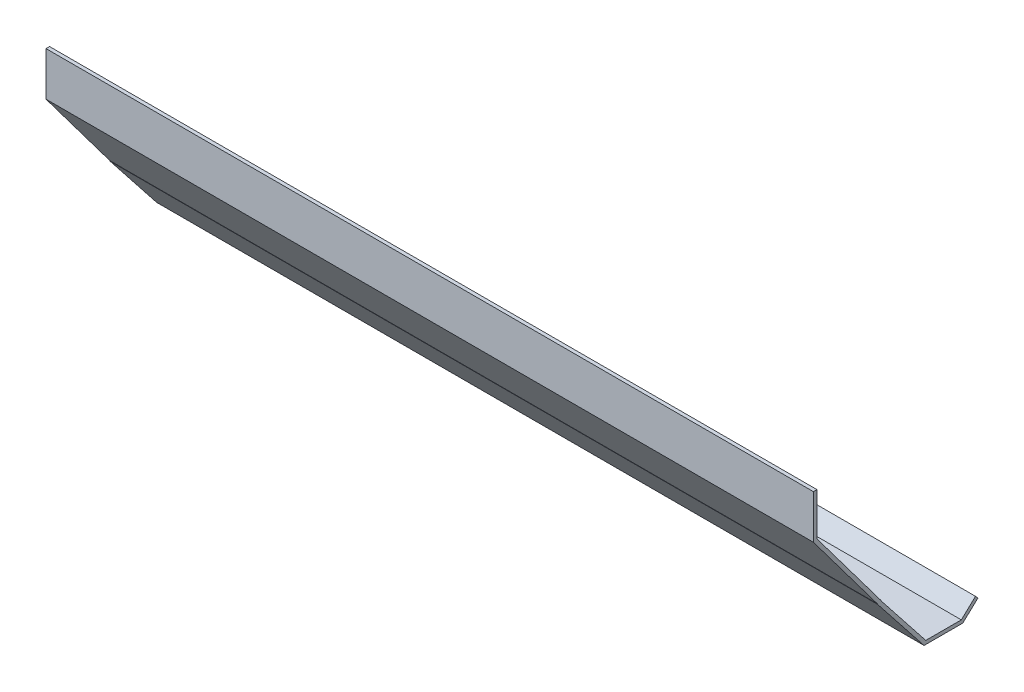
ISO-10303-21;
HEADER;
FILE_DESCRIPTION(('STEP AP214'),'2;1');
FILE_NAME('part.step','',(''),(''),'','','');
FILE_SCHEMA(('AUTOMOTIVE_DESIGN { 1 0 10303 214 1 1 1 1 }'));
ENDSEC;
DATA;
#1=APPLICATION_CONTEXT('core data for automotive mechanical design processes');
#2=APPLICATION_PROTOCOL_DEFINITION('international standard','automotive_design',2000,#1);
#3=PRODUCT_CONTEXT('',#1,'mechanical');
#4=PRODUCT('Part','Part','',(#3));
#5=PRODUCT_RELATED_PRODUCT_CATEGORY('part','',(#4));
#6=PRODUCT_DEFINITION_FORMATION('','',#4);
#7=PRODUCT_DEFINITION_CONTEXT('part definition',#1,'design');
#8=PRODUCT_DEFINITION('design','',#6,#7);
#9=PRODUCT_DEFINITION_SHAPE('','',#8);
#10=(LENGTH_UNIT() NAMED_UNIT(*) SI_UNIT(.MILLI.,.METRE.));
#11=(NAMED_UNIT(*) PLANE_ANGLE_UNIT() SI_UNIT($,.RADIAN.));
#12=(NAMED_UNIT(*) SI_UNIT($,.STERADIAN.) SOLID_ANGLE_UNIT());
#13=UNCERTAINTY_MEASURE_WITH_UNIT(LENGTH_MEASURE(1.E-05),#10,'distance_accuracy_value','');
#14=(GEOMETRIC_REPRESENTATION_CONTEXT(3) GLOBAL_UNCERTAINTY_ASSIGNED_CONTEXT((#13)) GLOBAL_UNIT_ASSIGNED_CONTEXT((#10,
#11,#12)) REPRESENTATION_CONTEXT('',''));
#15=CARTESIAN_POINT('',(0.,0.,0.));
#16=DIRECTION('',(0.,0.,1.));
#17=DIRECTION('',(1.,0.,0.));
#18=AXIS2_PLACEMENT_3D('',#15,#16,#17);
#19=CARTESIAN_POINT('',(685.8,0.,0.));
#20=DIRECTION('',(0.,-0.6,0.8));
#21=DIRECTION('',(0.,-0.8,-0.6));
#22=AXIS2_PLACEMENT_3D('',#19,#20,#21);
#23=PLANE('',#22);
#24=DIRECTION('',(0.,0.8,0.6));
#25=VECTOR('',#24,1.);
#26=CARTESIAN_POINT('',(0.,0.,0.));
#27=LINE('',#26,#25);
#28=CARTESIAN_POINT('',(0.,0.,0.));
#29=VERTEX_POINT('',#28);
#30=CARTESIAN_POINT('',(0.,76.2,57.15));
#31=VERTEX_POINT('',#30);
#32=EDGE_CURVE('E164',#29,#31,#27,.T.);
#33=ORIENTED_EDGE('',*,*,#32,.T.);
#34=DIRECTION('',(-1.,0.,0.));
#35=VECTOR('',#34,1.);
#36=CARTESIAN_POINT('',(685.8,76.2,57.15));
#37=LINE('',#36,#35);
#38=CARTESIAN_POINT('',(685.8,76.2,57.15));
#39=VERTEX_POINT('',#38);
#40=EDGE_CURVE('E11',#39,#31,#37,.T.);
#41=ORIENTED_EDGE('',*,*,#40,.F.);
#42=DIRECTION('',(0.,0.8,0.6));
#43=VECTOR('',#42,1.);
#44=CARTESIAN_POINT('',(685.8,0.,0.));
#45=LINE('',#44,#43);
#46=CARTESIAN_POINT('',(685.8,0.,0.));
#47=VERTEX_POINT('',#46);
#48=EDGE_CURVE('E190',#47,#39,#45,.T.);
#49=ORIENTED_EDGE('',*,*,#48,.F.);
#50=DIRECTION('',(-1.,0.,0.));
#51=VECTOR('',#50,1.);
#52=CARTESIAN_POINT('',(685.8,0.,0.));
#53=LINE('',#52,#51);
#54=EDGE_CURVE('E160',#47,#29,#53,.T.);
#55=ORIENTED_EDGE('',*,*,#54,.T.);
#56=EDGE_LOOP('',(#33,#41,#49,#55));
#57=FACE_BOUND('',#56,.T.);
#58=ADVANCED_FACE('F32',(#57),#23,.F.);
#59=CARTESIAN_POINT('',(685.8,76.2,57.15));
#60=DIRECTION('',(0.,0.,1.));
#61=DIRECTION('',(1.,0.,0.));
#62=AXIS2_PLACEMENT_3D('',#59,#60,#61);
#63=PLANE('',#62);
#64=DIRECTION('',(0.,1.,0.));
#65=VECTOR('',#64,1.);
#66=CARTESIAN_POINT('',(0.,76.2,57.15));
#67=LINE('',#66,#65);
#68=CARTESIAN_POINT('',(0.,114.3,57.15));
#69=VERTEX_POINT('',#68);
#70=EDGE_CURVE('E167',#31,#69,#67,.T.);
#71=ORIENTED_EDGE('',*,*,#70,.T.);
#72=DIRECTION('',(-1.,0.,0.));
#73=VECTOR('',#72,1.);
#74=CARTESIAN_POINT('',(685.8,114.3,57.15));
#75=LINE('',#74,#73);
#76=CARTESIAN_POINT('',(685.8,114.3,57.15));
#77=VERTEX_POINT('',#76);
#78=EDGE_CURVE('E40',#77,#69,#75,.T.);
#79=ORIENTED_EDGE('',*,*,#78,.F.);
#80=DIRECTION('',(0.,1.,0.));
#81=VECTOR('',#80,1.);
#82=CARTESIAN_POINT('',(685.8,76.2,57.15));
#83=LINE('',#82,#81);
#84=EDGE_CURVE('E109',#39,#77,#83,.T.);
#85=ORIENTED_EDGE('',*,*,#84,.F.);
#86=ORIENTED_EDGE('',*,*,#40,.T.);
#87=EDGE_LOOP('',(#71,#79,#85,#86));
#88=FACE_BOUND('',#87,.T.);
#89=ADVANCED_FACE('F278',(#88),#63,.F.);
#90=CARTESIAN_POINT('',(685.8,114.3,57.15));
#91=DIRECTION('',(0.,-1.,0.));
#92=DIRECTION('',(0.,0.,-1.));
#93=AXIS2_PLACEMENT_3D('',#90,#91,#92);
#94=PLANE('',#93);
#95=DIRECTION('',(0.,0.,1.));
#96=VECTOR('',#95,1.);
#97=CARTESIAN_POINT('',(0.,114.3,57.15));
#98=LINE('',#97,#96);
#99=CARTESIAN_POINT('',(0.,114.3,60.325));
#100=VERTEX_POINT('',#99);
#101=EDGE_CURVE('E169',#69,#100,#98,.T.);
#102=ORIENTED_EDGE('',*,*,#101,.T.);
#103=DIRECTION('',(-1.,0.,0.));
#104=VECTOR('',#103,1.);
#105=CARTESIAN_POINT('',(685.8,114.3,60.325));
#106=LINE('',#105,#104);
#107=CARTESIAN_POINT('',(685.8,114.3,60.325));
#108=VERTEX_POINT('',#107);
#109=EDGE_CURVE('E215',#108,#100,#106,.T.);
#110=ORIENTED_EDGE('',*,*,#109,.F.);
#111=DIRECTION('',(0.,0.,1.));
#112=VECTOR('',#111,1.);
#113=CARTESIAN_POINT('',(685.8,114.3,57.15));
#114=LINE('',#113,#112);
#115=EDGE_CURVE('E223',#77,#108,#114,.T.);
#116=ORIENTED_EDGE('',*,*,#115,.F.);
#117=ORIENTED_EDGE('',*,*,#78,.T.);
#118=EDGE_LOOP('',(#102,#110,#116,#117));
#119=FACE_BOUND('',#118,.T.);
#120=ADVANCED_FACE('F221',(#119),#94,.F.);
#121=CARTESIAN_POINT('',(685.8,114.3,60.325));
#122=DIRECTION('',(0.,0.,-1.));
#123=DIRECTION('',(0.,1.,0.));
#124=AXIS2_PLACEMENT_3D('',#121,#122,#123);
#125=PLANE('',#124);
#126=DIRECTION('',(0.,-1.,0.));
#127=VECTOR('',#126,1.);
#128=CARTESIAN_POINT('',(0.,114.3,60.325));
#129=LINE('',#128,#127);
#130=CARTESIAN_POINT('',(0.,75.1416666666667,60.325));
#131=VERTEX_POINT('',#130);
#132=EDGE_CURVE('E171',#100,#131,#129,.T.);
#133=ORIENTED_EDGE('',*,*,#132,.T.);
#134=DIRECTION('',(-1.,0.,0.));
#135=VECTOR('',#134,1.);
#136=CARTESIAN_POINT('',(685.8,75.1416666666667,60.325));
#137=LINE('',#136,#135);
#138=CARTESIAN_POINT('',(685.8,75.1416666666667,60.325));
#139=VERTEX_POINT('',#138);
#140=EDGE_CURVE('E212',#139,#131,#137,.T.);
#141=ORIENTED_EDGE('',*,*,#140,.F.);
#142=DIRECTION('',(0.,-1.,0.));
#143=VECTOR('',#142,1.);
#144=CARTESIAN_POINT('',(685.8,114.3,60.325));
#145=LINE('',#144,#143);
#146=EDGE_CURVE('E241',#108,#139,#145,.T.);
#147=ORIENTED_EDGE('',*,*,#146,.F.);
#148=ORIENTED_EDGE('',*,*,#109,.T.);
#149=EDGE_LOOP('',(#133,#141,#147,#148));
#150=FACE_BOUND('',#149,.T.);
#151=ADVANCED_FACE('F232',(#150),#125,.F.);
#152=CARTESIAN_POINT('',(685.8,75.1416666666667,60.325));
#153=DIRECTION('',(0.,0.6,-0.8));
#154=DIRECTION('',(0.,0.8,0.6));
#155=AXIS2_PLACEMENT_3D('',#152,#153,#154);
#156=PLANE('',#155);
#157=DIRECTION('',(0.,-0.8,-0.6));
#158=VECTOR('',#157,1.);
#159=CARTESIAN_POINT('',(0.,75.1416666666667,60.325));
#160=LINE('',#159,#158);
#161=CARTESIAN_POINT('',(0.,-1.05833333333329,3.17499999999999));
#162=VERTEX_POINT('',#161);
#163=EDGE_CURVE('E173',#131,#162,#160,.T.);
#164=ORIENTED_EDGE('',*,*,#163,.T.);
#165=DIRECTION('',(-1.,0.,0.));
#166=VECTOR('',#165,1.);
#167=CARTESIAN_POINT('',(685.8,-1.05833333333329,3.17499999999999));
#168=LINE('',#167,#166);
#169=CARTESIAN_POINT('',(685.8,-1.05833333333329,3.17499999999999));
#170=VERTEX_POINT('',#169);
#171=EDGE_CURVE('E209',#170,#162,#168,.T.);
#172=ORIENTED_EDGE('',*,*,#171,.F.);
#173=DIRECTION('',(0.,-0.8,-0.6));
#174=VECTOR('',#173,1.);
#175=CARTESIAN_POINT('',(685.8,75.1416666666667,60.325));
#176=LINE('',#175,#174);
#177=EDGE_CURVE('E238',#139,#170,#176,.T.);
#178=ORIENTED_EDGE('',*,*,#177,.F.);
#179=ORIENTED_EDGE('',*,*,#140,.T.);
#180=EDGE_LOOP('',(#164,#172,#178,#179));
#181=FACE_BOUND('',#180,.T.);
#182=ADVANCED_FACE('F236',(#181),#156,.F.);
#183=CARTESIAN_POINT('',(685.8,-1.05833333333329,3.17499999999999));
#184=DIRECTION('',(0.,0.,-1.));
#185=DIRECTION('',(0.,1.,0.));
#186=AXIS2_PLACEMENT_3D('',#183,#184,#185);
#187=PLANE('',#186);
#188=DIRECTION('',(0.,-1.,0.));
#189=VECTOR('',#188,1.);
#190=CARTESIAN_POINT('',(0.,-1.05833333333329,3.17499999999999));
#191=LINE('',#190,#189);
#192=CARTESIAN_POINT('',(0.,-1.35681744300096,3.17499999999999));
#193=VERTEX_POINT('',#192);
#194=EDGE_CURVE('E175',#162,#193,#191,.T.);
#195=ORIENTED_EDGE('',*,*,#194,.T.);
#196=DIRECTION('',(-1.,0.,0.));
#197=VECTOR('',#196,1.);
#198=CARTESIAN_POINT('',(685.8,-1.35681744300096,3.17499999999999));
#199=LINE('',#198,#197);
#200=CARTESIAN_POINT('',(685.8,-1.35681744300096,3.17499999999999));
#201=VERTEX_POINT('',#200);
#202=EDGE_CURVE('E206',#201,#193,#199,.T.);
#203=ORIENTED_EDGE('',*,*,#202,.F.);
#204=DIRECTION('',(0.,-1.,0.));
#205=VECTOR('',#204,1.);
#206=CARTESIAN_POINT('',(685.8,-1.05833333333329,3.17499999999999));
#207=LINE('',#206,#205);
#208=EDGE_CURVE('E240',#170,#201,#207,.T.);
#209=ORIENTED_EDGE('',*,*,#208,.F.);
#210=ORIENTED_EDGE('',*,*,#171,.T.);
#211=EDGE_LOOP('',(#195,#203,#209,#210));
#212=FACE_BOUND('',#211,.T.);
#213=ADVANCED_FACE('F291',(#212),#187,.F.);
#214=CARTESIAN_POINT('',(685.8,-1.35681744300096,3.17499999999999));
#215=DIRECTION('',(0.,0.61989867506062,-0.784681867165342));
#216=DIRECTION('',(0.,0.784681867165342,0.61989867506062));
#217=AXIS2_PLACEMENT_3D('',#214,#215,#216);
#218=PLANE('',#217);
#219=DIRECTION('',(0.,-0.784681867165342,-0.61989867506062));
#220=VECTOR('',#219,1.);
#221=CARTESIAN_POINT('',(0.,-1.35681744300096,3.17499999999999));
#222=LINE('',#221,#220);
#223=CARTESIAN_POINT('',(0.,-54.229,-38.5940242200292));
#224=VERTEX_POINT('',#223);
#225=EDGE_CURVE('E177',#193,#224,#222,.T.);
#226=ORIENTED_EDGE('',*,*,#225,.T.);
#227=DIRECTION('',(-1.,0.,0.));
#228=VECTOR('',#227,1.);
#229=CARTESIAN_POINT('',(685.8,-54.229,-38.5940242200292));
#230=LINE('',#229,#228);
#231=CARTESIAN_POINT('',(685.8,-54.229,-38.5940242200292));
#232=VERTEX_POINT('',#231);
#233=EDGE_CURVE('E203',#232,#224,#230,.T.);
#234=ORIENTED_EDGE('',*,*,#233,.F.);
#235=DIRECTION('',(0.,-0.784681867165342,-0.61989867506062));
#236=VECTOR('',#235,1.);
#237=CARTESIAN_POINT('',(685.8,-1.35681744300096,3.17499999999999));
#238=LINE('',#237,#236);
#239=EDGE_CURVE('E243',#201,#232,#238,.T.);
#240=ORIENTED_EDGE('',*,*,#239,.F.);
#241=ORIENTED_EDGE('',*,*,#202,.T.);
#242=EDGE_LOOP('',(#226,#234,#240,#241));
#243=FACE_BOUND('',#242,.T.);
#244=ADVANCED_FACE('F294',(#243),#218,.F.);
#245=CARTESIAN_POINT('',(685.8,-54.229,-38.5940242200292));
#246=DIRECTION('',(0.,1.,0.));
#247=DIRECTION('',(0.,0.,1.));
#248=AXIS2_PLACEMENT_3D('',#245,#246,#247);
#249=PLANE('',#248);
#250=DIRECTION('',(0.,0.,-1.));
#251=VECTOR('',#250,1.);
#252=CARTESIAN_POINT('',(0.,-54.229,-38.5940242200292));
#253=LINE('',#252,#251);
#254=CARTESIAN_POINT('',(0.,-54.229,-73.2357240911878));
#255=VERTEX_POINT('',#254);
#256=EDGE_CURVE('E179',#224,#255,#253,.T.);
#257=ORIENTED_EDGE('',*,*,#256,.T.);
#258=DIRECTION('',(-1.,0.,0.));
#259=VECTOR('',#258,1.);
#260=CARTESIAN_POINT('',(685.8,-54.229,-73.2357240911878));
#261=LINE('',#260,#259);
#262=CARTESIAN_POINT('',(685.8,-54.229,-73.2357240911878));
#263=VERTEX_POINT('',#262);
#264=EDGE_CURVE('E200',#263,#255,#261,.T.);
#265=ORIENTED_EDGE('',*,*,#264,.F.);
#266=DIRECTION('',(0.,0.,-1.));
#267=VECTOR('',#266,1.);
#268=CARTESIAN_POINT('',(685.8,-54.229,-38.5940242200292));
#269=LINE('',#268,#267);
#270=EDGE_CURVE('E249',#232,#263,#269,.T.);
#271=ORIENTED_EDGE('',*,*,#270,.F.);
#272=ORIENTED_EDGE('',*,*,#233,.T.);
#273=EDGE_LOOP('',(#257,#265,#271,#272));
#274=FACE_BOUND('',#273,.T.);
#275=ADVANCED_FACE('F298',(#274),#249,.F.);
#276=CARTESIAN_POINT('',(685.8,-54.229,-73.2357240911878));
#277=DIRECTION('',(0.,0.729942991089569,0.683508031963936));
#278=DIRECTION('',(0.,-0.683508031963936,0.729942991089569));
#279=AXIS2_PLACEMENT_3D('',#276,#277,#278);
#280=PLANE('',#279);
#281=DIRECTION('',(0.,0.683508031963936,-0.729942991089569));
#282=VECTOR('',#281,1.);
#283=CARTESIAN_POINT('',(0.,-54.229,-73.2357240911878));
#284=LINE('',#283,#282);
#285=CARTESIAN_POINT('',(0.,-41.529,-86.7985142170055));
#286=VERTEX_POINT('',#285);
#287=EDGE_CURVE('E181',#255,#286,#284,.T.);
#288=ORIENTED_EDGE('',*,*,#287,.T.);
#289=DIRECTION('',(-1.,0.,0.));
#290=VECTOR('',#289,1.);
#291=CARTESIAN_POINT('',(685.8,-41.529,-86.7985142170055));
#292=LINE('',#291,#290);
#293=CARTESIAN_POINT('',(685.8,-41.529,-86.7985142170055));
#294=VERTEX_POINT('',#293);
#295=EDGE_CURVE('E197',#294,#286,#292,.T.);
#296=ORIENTED_EDGE('',*,*,#295,.F.);
#297=DIRECTION('',(0.,0.683508031963936,-0.729942991089569));
#298=VECTOR('',#297,1.);
#299=CARTESIAN_POINT('',(685.8,-54.229,-73.2357240911878));
#300=LINE('',#299,#298);
#301=EDGE_CURVE('E251',#263,#294,#300,.T.);
#302=ORIENTED_EDGE('',*,*,#301,.F.);
#303=ORIENTED_EDGE('',*,*,#264,.T.);
#304=EDGE_LOOP('',(#288,#296,#302,#303));
#305=FACE_BOUND('',#304,.T.);
#306=ADVANCED_FACE('F302',(#305),#280,.F.);
#307=CARTESIAN_POINT('',(685.8,-41.529,-86.7985142170055));
#308=DIRECTION('',(0.,-0.683508031963937,0.729942991089568));
#309=DIRECTION('',(0.,-0.729942991089568,-0.683508031963937));
#310=AXIS2_PLACEMENT_3D('',#307,#308,#309);
#311=PLANE('',#310);
#312=DIRECTION('',(0.,0.729942991089568,0.683508031963937));
#313=VECTOR('',#312,1.);
#314=CARTESIAN_POINT('',(0.,-41.529,-86.7985142170055));
#315=LINE('',#314,#313);
#316=CARTESIAN_POINT('',(0.,-39.161904162509,-84.582));
#317=VERTEX_POINT('',#316);
#318=EDGE_CURVE('E183',#286,#317,#315,.T.);
#319=ORIENTED_EDGE('',*,*,#318,.T.);
#320=DIRECTION('',(-1.,0.,0.));
#321=VECTOR('',#320,1.);
#322=CARTESIAN_POINT('',(685.8,-39.161904162509,-84.582));
#323=LINE('',#322,#321);
#324=CARTESIAN_POINT('',(685.8,-39.161904162509,-84.582));
#325=VERTEX_POINT('',#324);
#326=EDGE_CURVE('E194',#325,#317,#323,.T.);
#327=ORIENTED_EDGE('',*,*,#326,.F.);
#328=DIRECTION('',(0.,0.729942991089568,0.683508031963937));
#329=VECTOR('',#328,1.);
#330=CARTESIAN_POINT('',(685.8,-41.529,-86.7985142170055));
#331=LINE('',#330,#329);
#332=EDGE_CURVE('E253',#294,#325,#331,.T.);
#333=ORIENTED_EDGE('',*,*,#332,.F.);
#334=ORIENTED_EDGE('',*,*,#295,.T.);
#335=EDGE_LOOP('',(#319,#327,#333,#334));
#336=FACE_BOUND('',#335,.T.);
#337=ADVANCED_FACE('F259',(#336),#311,.F.);
#338=CARTESIAN_POINT('',(685.8,-39.161904162509,-84.582));
#339=DIRECTION('',(0.,-0.729942991089569,-0.683508031963936));
#340=DIRECTION('',(0.,0.683508031963936,-0.729942991089569));
#341=AXIS2_PLACEMENT_3D('',#338,#339,#340);
#342=PLANE('',#341);
#343=DIRECTION('',(0.,-0.683508031963936,0.729942991089569));
#344=VECTOR('',#343,1.);
#345=CARTESIAN_POINT('',(0.,-39.161904162509,-84.582));
#346=LINE('',#345,#344);
#347=CARTESIAN_POINT('',(0.,-51.054,-71.882));
#348=VERTEX_POINT('',#347);
#349=EDGE_CURVE('E185',#317,#348,#346,.T.);
#350=ORIENTED_EDGE('',*,*,#349,.T.);
#351=DIRECTION('',(-1.,0.,0.));
#352=VECTOR('',#351,1.);
#353=CARTESIAN_POINT('',(685.8,-51.054,-71.882));
#354=LINE('',#353,#352);
#355=CARTESIAN_POINT('',(685.8,-51.054,-71.882));
#356=VERTEX_POINT('',#355);
#357=EDGE_CURVE('E155',#356,#348,#354,.T.);
#358=ORIENTED_EDGE('',*,*,#357,.F.);
#359=DIRECTION('',(0.,-0.683508031963936,0.729942991089569));
#360=VECTOR('',#359,1.);
#361=CARTESIAN_POINT('',(685.8,-39.161904162509,-84.582));
#362=LINE('',#361,#360);
#363=EDGE_CURVE('E146',#325,#356,#362,.T.);
#364=ORIENTED_EDGE('',*,*,#363,.F.);
#365=ORIENTED_EDGE('',*,*,#326,.T.);
#366=EDGE_LOOP('',(#350,#358,#364,#365));
#367=FACE_BOUND('',#366,.T.);
#368=ADVANCED_FACE('F263',(#367),#342,.F.);
#369=CARTESIAN_POINT('',(685.8,-51.054,-71.882));
#370=DIRECTION('',(0.,-1.,0.));
#371=DIRECTION('',(0.,0.,-1.));
#372=AXIS2_PLACEMENT_3D('',#369,#370,#371);
#373=PLANE('',#372);
#374=DIRECTION('',(0.,0.,1.));
#375=VECTOR('',#374,1.);
#376=CARTESIAN_POINT('',(0.,-51.054,-71.882));
#377=LINE('',#376,#375);
#378=CARTESIAN_POINT('',(0.,-51.054,-40.132));
#379=VERTEX_POINT('',#378);
#380=EDGE_CURVE('E154',#348,#379,#377,.T.);
#381=ORIENTED_EDGE('',*,*,#380,.T.);
#382=DIRECTION('',(-1.,0.,0.));
#383=VECTOR('',#382,1.);
#384=CARTESIAN_POINT('',(685.8,-51.054,-40.132));
#385=LINE('',#384,#383);
#386=CARTESIAN_POINT('',(685.8,-51.054,-40.132));
#387=VERTEX_POINT('',#386);
#388=EDGE_CURVE('E151',#387,#379,#385,.T.);
#389=ORIENTED_EDGE('',*,*,#388,.F.);
#390=DIRECTION('',(0.,0.,1.));
#391=VECTOR('',#390,1.);
#392=CARTESIAN_POINT('',(685.8,-51.054,-71.882));
#393=LINE('',#392,#391);
#394=EDGE_CURVE('E140',#356,#387,#393,.T.);
#395=ORIENTED_EDGE('',*,*,#394,.F.);
#396=ORIENTED_EDGE('',*,*,#357,.T.);
#397=EDGE_LOOP('',(#381,#389,#395,#396));
#398=FACE_BOUND('',#397,.T.);
#399=ADVANCED_FACE('F152',(#398),#373,.F.);
#400=CARTESIAN_POINT('',(685.8,-51.054,-40.132));
#401=DIRECTION('',(0.,-0.61989867506062,0.784681867165342));
#402=DIRECTION('',(0.,-0.784681867165342,-0.61989867506062));
#403=AXIS2_PLACEMENT_3D('',#400,#401,#402);
#404=PLANE('',#403);
#405=DIRECTION('',(0.,0.784681867165342,0.61989867506062));
#406=VECTOR('',#405,1.);
#407=CARTESIAN_POINT('',(0.,-51.054,-40.132));
#408=LINE('',#407,#406);
#409=CARTESIAN_POINT('',(0.,-0.254000000000001,0.));
#410=VERTEX_POINT('',#409);
#411=EDGE_CURVE('E95',#379,#410,#408,.T.);
#412=ORIENTED_EDGE('',*,*,#411,.T.);
#413=DIRECTION('',(-1.,0.,0.));
#414=VECTOR('',#413,1.);
#415=CARTESIAN_POINT('',(685.8,-0.254000000000001,0.));
#416=LINE('',#415,#414);
#417=CARTESIAN_POINT('',(685.8,-0.254000000000001,0.));
#418=VERTEX_POINT('',#417);
#419=EDGE_CURVE('E156',#418,#410,#416,.T.);
#420=ORIENTED_EDGE('',*,*,#419,.F.);
#421=DIRECTION('',(0.,0.784681867165342,0.61989867506062));
#422=VECTOR('',#421,1.);
#423=CARTESIAN_POINT('',(685.8,-51.054,-40.132));
#424=LINE('',#423,#422);
#425=EDGE_CURVE('E144',#387,#418,#424,.T.);
#426=ORIENTED_EDGE('',*,*,#425,.F.);
#427=ORIENTED_EDGE('',*,*,#388,.T.);
#428=EDGE_LOOP('',(#412,#420,#426,#427));
#429=FACE_BOUND('',#428,.T.);
#430=ADVANCED_FACE('F158',(#429),#404,.F.);
#431=CARTESIAN_POINT('',(685.8,-0.254000000000001,0.));
#432=DIRECTION('',(0.,0.,1.));
#433=DIRECTION('',(1.,0.,0.));
#434=AXIS2_PLACEMENT_3D('',#431,#432,#433);
#435=PLANE('',#434);
#436=DIRECTION('',(0.,1.,0.));
#437=VECTOR('',#436,1.);
#438=CARTESIAN_POINT('',(0.,-0.254000000000001,0.));
#439=LINE('',#438,#437);
#440=EDGE_CURVE('E101',#410,#29,#439,.T.);
#441=ORIENTED_EDGE('',*,*,#440,.T.);
#442=ORIENTED_EDGE('',*,*,#54,.F.);
#443=DIRECTION('',(0.,1.,0.));
#444=VECTOR('',#443,1.);
#445=CARTESIAN_POINT('',(685.8,-0.254000000000001,0.));
#446=LINE('',#445,#444);
#447=EDGE_CURVE('E48',#418,#47,#446,.T.);
#448=ORIENTED_EDGE('',*,*,#447,.F.);
#449=ORIENTED_EDGE('',*,*,#419,.T.);
#450=EDGE_LOOP('',(#441,#442,#448,#449));
#451=FACE_BOUND('',#450,.T.);
#452=ADVANCED_FACE('F267',(#451),#435,.F.);
#453=CARTESIAN_POINT('',(685.8,0.,0.));
#454=DIRECTION('',(-1.,0.,0.));
#455=DIRECTION('',(0.,0.,1.));
#456=AXIS2_PLACEMENT_3D('',#453,#454,#455);
#457=PLANE('',#456);
#458=ORIENTED_EDGE('',*,*,#48,.T.);
#459=ORIENTED_EDGE('',*,*,#84,.T.);
#460=ORIENTED_EDGE('',*,*,#115,.T.);
#461=ORIENTED_EDGE('',*,*,#146,.T.);
#462=ORIENTED_EDGE('',*,*,#177,.T.);
#463=ORIENTED_EDGE('',*,*,#208,.T.);
#464=ORIENTED_EDGE('',*,*,#239,.T.);
#465=ORIENTED_EDGE('',*,*,#270,.T.);
#466=ORIENTED_EDGE('',*,*,#301,.T.);
#467=ORIENTED_EDGE('',*,*,#332,.T.);
#468=ORIENTED_EDGE('',*,*,#363,.T.);
#469=ORIENTED_EDGE('',*,*,#394,.T.);
#470=ORIENTED_EDGE('',*,*,#425,.T.);
#471=ORIENTED_EDGE('',*,*,#447,.T.);
#472=EDGE_LOOP('',(#458,#459,#460,#461,#462,#463,#464,#465,#466,#467,#468,#469,#470,#471));
#473=FACE_BOUND('',#472,.T.);
#474=ADVANCED_FACE('F142',(#473),#457,.F.);
#475=CARTESIAN_POINT('',(0.,0.,0.));
#476=DIRECTION('',(-1.,0.,0.));
#477=DIRECTION('',(0.,0.,1.));
#478=AXIS2_PLACEMENT_3D('',#475,#476,#477);
#479=PLANE('',#478);
#480=ORIENTED_EDGE('',*,*,#32,.F.);
#481=ORIENTED_EDGE('',*,*,#440,.F.);
#482=ORIENTED_EDGE('',*,*,#411,.F.);
#483=ORIENTED_EDGE('',*,*,#380,.F.);
#484=ORIENTED_EDGE('',*,*,#349,.F.);
#485=ORIENTED_EDGE('',*,*,#318,.F.);
#486=ORIENTED_EDGE('',*,*,#287,.F.);
#487=ORIENTED_EDGE('',*,*,#256,.F.);
#488=ORIENTED_EDGE('',*,*,#225,.F.);
#489=ORIENTED_EDGE('',*,*,#194,.F.);
#490=ORIENTED_EDGE('',*,*,#163,.F.);
#491=ORIENTED_EDGE('',*,*,#132,.F.);
#492=ORIENTED_EDGE('',*,*,#101,.F.);
#493=ORIENTED_EDGE('',*,*,#70,.F.);
#494=EDGE_LOOP('',(#480,#481,#482,#483,#484,#485,#486,#487,#488,#489,#490,#491,#492,#493));
#495=FACE_BOUND('',#494,.T.);
#496=ADVANCED_FACE('F227',(#495),#479,.T.);
#497=CLOSED_SHELL('',(#58,#89,#120,#151,#182,#213,#244,#275,#306,#337,#368,#399,#430,#452,#474,#496));
#498=MANIFOLD_SOLID_BREP('B2',#497);
#499=ADVANCED_BREP_SHAPE_REPRESENTATION('',(#18,#498),#14);
#500=SHAPE_DEFINITION_REPRESENTATION(#9,#499);
ENDSEC;
END-ISO-10303-21;
